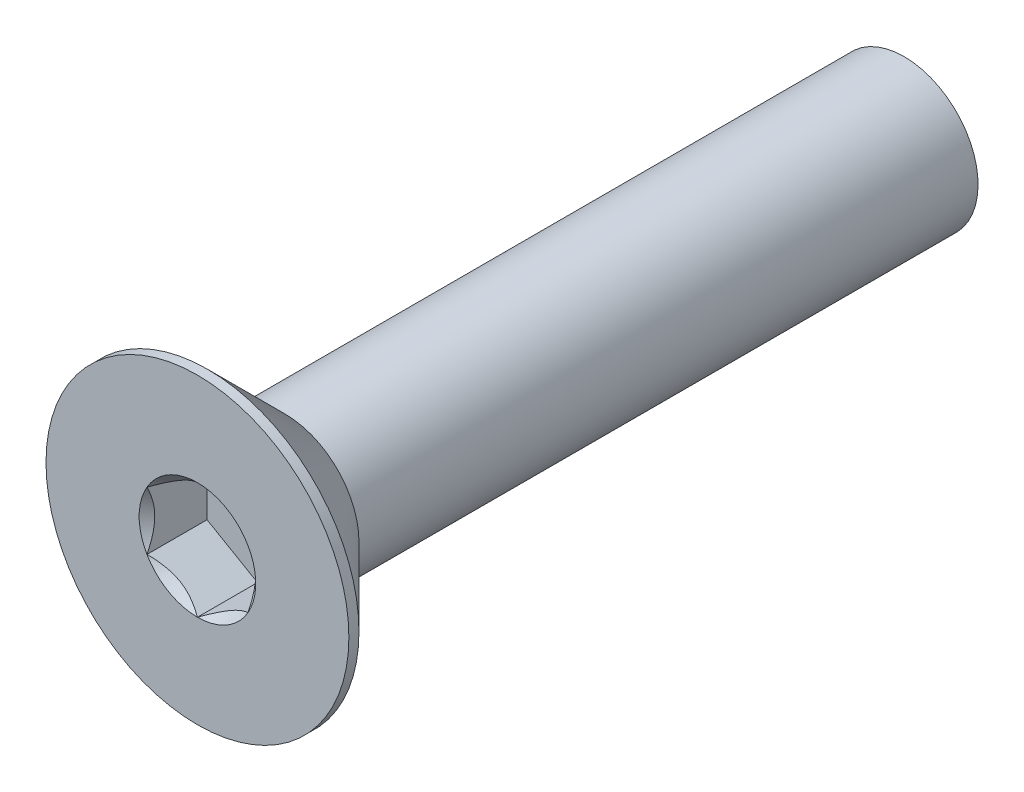
ISO-10303-21;
HEADER;
FILE_DESCRIPTION(('STEP AP214'),'2;1');
FILE_NAME('part.step','',(''),(''),'','','');
FILE_SCHEMA(('AUTOMOTIVE_DESIGN { 1 0 10303 214 1 1 1 1 }'));
ENDSEC;
DATA;
#1=APPLICATION_CONTEXT('core data for automotive mechanical design processes');
#2=APPLICATION_PROTOCOL_DEFINITION('international standard','automotive_design',2000,#1);
#3=PRODUCT_CONTEXT('',#1,'mechanical');
#4=PRODUCT('Part','Part','',(#3));
#5=PRODUCT_RELATED_PRODUCT_CATEGORY('part','',(#4));
#6=PRODUCT_DEFINITION_FORMATION('','',#4);
#7=PRODUCT_DEFINITION_CONTEXT('part definition',#1,'design');
#8=PRODUCT_DEFINITION('design','',#6,#7);
#9=PRODUCT_DEFINITION_SHAPE('','',#8);
#10=(LENGTH_UNIT() NAMED_UNIT(*) SI_UNIT(.MILLI.,.METRE.));
#11=(NAMED_UNIT(*) PLANE_ANGLE_UNIT() SI_UNIT($,.RADIAN.));
#12=(NAMED_UNIT(*) SI_UNIT($,.STERADIAN.) SOLID_ANGLE_UNIT());
#13=UNCERTAINTY_MEASURE_WITH_UNIT(LENGTH_MEASURE(1.E-05),#10,'distance_accuracy_value','');
#14=(GEOMETRIC_REPRESENTATION_CONTEXT(3) GLOBAL_UNCERTAINTY_ASSIGNED_CONTEXT((#13)) GLOBAL_UNIT_ASSIGNED_CONTEXT((#10,
#11,#12)) REPRESENTATION_CONTEXT('',''));
#15=CARTESIAN_POINT('',(0.,0.,0.));
#16=DIRECTION('',(0.,0.,1.));
#17=DIRECTION('',(1.,0.,0.));
#18=AXIS2_PLACEMENT_3D('',#15,#16,#17);
#19=CARTESIAN_POINT('',(1.,-0.577350269189626,-1.19));
#20=DIRECTION('',(0.,0.,1.));
#21=DIRECTION('',(1.,0.,0.));
#22=AXIS2_PLACEMENT_3D('',#19,#20,#21);
#23=PLANE('',#22);
#24=DIRECTION('',(0.,1.,0.));
#25=VECTOR('',#24,1.);
#26=CARTESIAN_POINT('',(-1.,0.577350269189626,-1.19));
#27=LINE('',#26,#25);
#28=CARTESIAN_POINT('',(-0.999999999999999,0.577350269189625,-1.19));
#29=VERTEX_POINT('',#28);
#30=CARTESIAN_POINT('',(-1.,-0.577350269189626,-1.19));
#31=VERTEX_POINT('',#30);
#32=EDGE_CURVE('E83',#29,#31,#27,.F.);
#33=ORIENTED_EDGE('',*,*,#32,.T.);
#34=DIRECTION('',(0.866025403784439,-0.5,0.));
#35=VECTOR('',#34,1.);
#36=CARTESIAN_POINT('',(-1.,-0.577350269189626,-1.19));
#37=LINE('',#36,#35);
#38=CARTESIAN_POINT('',(0.,-1.15470053837925,-1.19));
#39=VERTEX_POINT('',#38);
#40=EDGE_CURVE('E85',#31,#39,#37,.T.);
#41=ORIENTED_EDGE('',*,*,#40,.T.);
#42=DIRECTION('',(0.866025403784439,0.5,0.));
#43=VECTOR('',#42,1.);
#44=CARTESIAN_POINT('',(0.,-1.15470053837925,-1.19));
#45=LINE('',#44,#43);
#46=CARTESIAN_POINT('',(1.,-0.577350269189626,-1.19));
#47=VERTEX_POINT('',#46);
#48=EDGE_CURVE('E86',#39,#47,#45,.T.);
#49=ORIENTED_EDGE('',*,*,#48,.T.);
#50=DIRECTION('',(0.,1.,0.));
#51=VECTOR('',#50,1.);
#52=CARTESIAN_POINT('',(1.,-0.577350269189626,-1.19));
#53=LINE('',#52,#51);
#54=CARTESIAN_POINT('',(1.,0.577350269189626,-1.19));
#55=VERTEX_POINT('',#54);
#56=EDGE_CURVE('E72',#47,#55,#53,.T.);
#57=ORIENTED_EDGE('',*,*,#56,.T.);
#58=DIRECTION('',(-0.866025403784439,0.5,0.));
#59=VECTOR('',#58,1.);
#60=CARTESIAN_POINT('',(1.,0.577350269189626,-1.19));
#61=LINE('',#60,#59);
#62=CARTESIAN_POINT('',(0.,1.15470053837925,-1.19));
#63=VERTEX_POINT('',#62);
#64=EDGE_CURVE('E111',#55,#63,#61,.T.);
#65=ORIENTED_EDGE('',*,*,#64,.T.);
#66=DIRECTION('',(-0.866025403784439,-0.5,0.));
#67=VECTOR('',#66,1.);
#68=CARTESIAN_POINT('',(0.,1.15470053837925,-1.19));
#69=LINE('',#68,#67);
#70=EDGE_CURVE('E116',#63,#29,#69,.T.);
#71=ORIENTED_EDGE('',*,*,#70,.T.);
#72=EDGE_LOOP('',(#33,#41,#49,#57,#65,#71));
#73=FACE_BOUND('',#72,.T.);
#74=ADVANCED_FACE('F17',(#73),#23,.T.);
#75=CARTESIAN_POINT('',(0.,-1.15470053837925,-1.19));
#76=DIRECTION('',(0.5,-0.866025403784439,0.));
#77=DIRECTION('',(0.866025403784439,0.5,0.));
#78=AXIS2_PLACEMENT_3D('',#75,#76,#77);
#79=PLANE('',#78);
#80=CARTESIAN_POINT('',(-3.93149009094201E-11,-1.15470053837926,-9.981088786407E-11));
#81=CARTESIAN_POINT('',(0.0343705355201057,-1.13485670043636,-0.019824700422141));
#82=CARTESIAN_POINT('',(0.0693156756519455,-1.11468111438035,-0.0384849664872145));
#83=CARTESIAN_POINT('',(0.140572403035621,-1.07354102364821,-0.0726511232407905));
#84=CARTESIAN_POINT('',(0.176890763106012,-1.05257260868342,-0.0881380101422933));
#85=CARTESIAN_POINT('',(0.250125097696328,-1.01029074589262,-0.11466695978462));
#86=CARTESIAN_POINT('',(0.287022429458597,-0.988988061467716,-0.125775687570534));
#87=CARTESIAN_POINT('',(0.361628600499482,-0.945914168534358,-0.142891513233382));
#88=CARTESIAN_POINT('',(0.399335163701569,-0.924144274119301,-0.148911380305544));
#89=CARTESIAN_POINT('',(0.464327716043936,-0.886620806529054,-0.154341115390247));
#90=CARTESIAN_POINT('',(0.491529304810035,-0.87091596193258,-0.155143433217331));
#91=CARTESIAN_POINT('',(0.545879708710831,-0.839536741609904,-0.153791220399352));
#92=CARTESIAN_POINT('',(0.573028510861523,-0.823862373380022,-0.151636036594819));
#93=CARTESIAN_POINT('',(0.654087027893978,-0.777063216751215,-0.140876680449877));
#94=CARTESIAN_POINT('',(0.707593237347495,-0.746171392319914,-0.127977491939688));
#95=CARTESIAN_POINT('',(0.801462739355952,-0.691975810066637,-0.0968623195341796));
#96=CARTESIAN_POINT('',(0.842267871071583,-0.668416956286299,-0.0802830124023648));
#97=CARTESIAN_POINT('',(0.922281198810023,-0.622221239977752,-0.0429387151524039));
#98=CARTESIAN_POINT('',(0.961494106307927,-0.599581657278129,-0.0221873504710733));
#99=CARTESIAN_POINT('',(1.00000000003183,-0.577350269171246,-1.09229319045489E-10));
#100=B_SPLINE_CURVE_WITH_KNOTS('',3,(#80,#81,#82,#83,#84,#85,#86,#87,#88,#89,#90,#91,#92,#93,
#94,#95,#96,#97,#98,#99),.UNSPECIFIED.,.F.,.F.,(4,2,2,2,2,2,2,2,2,4),(0.,0.133182946587487,
0.267141541479663,0.398973326833972,0.530473323727982,0.624596460473079,0.718740387507005,
0.907081600610891,1.05673041335255,1.20589820631879),.UNSPECIFIED.);
#101=CARTESIAN_POINT('',(0.,-1.15470053839843,-1.08428152754095E-10));
#102=VERTEX_POINT('',#101);
#103=CARTESIAN_POINT('',(1.00000000001661,-0.577350269199215,-1.08427887794916E-10));
#104=VERTEX_POINT('',#103);
#105=EDGE_CURVE('E20',#102,#104,#100,.T.);
#106=ORIENTED_EDGE('',*,*,#105,.T.);
#107=DIRECTION('',(0.,0.,-1.));
#108=VECTOR('',#107,1.);
#109=CARTESIAN_POINT('',(1.,-0.577350269189626,-1.19));
#110=LINE('',#109,#108);
#111=EDGE_CURVE('E91',#104,#47,#110,.T.);
#112=ORIENTED_EDGE('',*,*,#111,.T.);
#113=ORIENTED_EDGE('',*,*,#48,.F.);
#114=DIRECTION('',(0.,0.,1.));
#115=VECTOR('',#114,1.);
#116=CARTESIAN_POINT('',(0.,-1.15470053837925,-1.19));
#117=LINE('',#116,#115);
#118=EDGE_CURVE('E59',#39,#102,#117,.T.);
#119=ORIENTED_EDGE('',*,*,#118,.T.);
#120=EDGE_LOOP('',(#106,#112,#113,#119));
#121=FACE_BOUND('',#120,.T.);
#122=ADVANCED_FACE('F90',(#121),#79,.F.);
#123=CARTESIAN_POINT('',(-1.,-0.577350269189626,-1.19));
#124=DIRECTION('',(-0.5,-0.866025403784439,0.));
#125=DIRECTION('',(0.866025403784439,-0.5,0.));
#126=AXIS2_PLACEMENT_3D('',#123,#124,#125);
#127=PLANE('',#126);
#128=CARTESIAN_POINT('',(-1.00000000001966,-0.577350269155583,-9.98096334677502E-11));
#129=CARTESIAN_POINT('',(-0.965629464472823,-0.597194107120269,-0.0198247004221396));
#130=CARTESIAN_POINT('',(-0.930684324346155,-0.617369693185242,-0.0384849664872131));
#131=CARTESIAN_POINT('',(-0.859427596966287,-0.658509783923978,-0.0726511232407891));
#132=CARTESIAN_POINT('',(-0.823109236894494,-0.679478198886334,-0.0881380101422919));
#133=CARTESIAN_POINT('',(-0.749874902303172,-0.721760061675394,-0.114666959784619));
#134=CARTESIAN_POINT('',(-0.71297757054127,-0.743062746100931,-0.125775687570532));
#135=CARTESIAN_POINT('',(-0.638371399500649,-0.786136639034746,-0.14289151323338));
#136=CARTESIAN_POINT('',(-0.600664836298461,-0.807906533449627,-0.148911380305542));
#137=CARTESIAN_POINT('',(-0.535672283956042,-0.845430001039785,-0.154341115390246));
#138=CARTESIAN_POINT('',(-0.508470695189959,-0.861134845636286,-0.155143433217329));
#139=CARTESIAN_POINT('',(-0.454120291289175,-0.892514065958982,-0.15379122039935));
#140=CARTESIAN_POINT('',(-0.426971489138479,-0.908188434188858,-0.151636036594817));
#141=CARTESIAN_POINT('',(-0.345912972106017,-0.954987590817655,-0.140876680449876));
#142=CARTESIAN_POINT('',(-0.292406762652503,-0.985879415248961,-0.127977491939686));
#143=CARTESIAN_POINT('',(-0.198537260644048,-1.04007499750224,-0.0968623195341786));
#144=CARTESIAN_POINT('',(-0.157732128928417,-1.06363385128258,-0.0802830124023638));
#145=CARTESIAN_POINT('',(-0.0777188011899764,-1.10982956759112,-0.0429387151524029));
#146=CARTESIAN_POINT('',(-0.0385058936920724,-1.13246915029075,-0.0221873504710723));
#147=CARTESIAN_POINT('',(3.18328951443562E-11,-1.15470053839763,-1.09228385770901E-10));
#148=B_SPLINE_CURVE_WITH_KNOTS('',3,(#128,#129,#130,#131,#132,#133,#134,#135,#136,#137,#138,
#139,#140,#141,#142,#143,#144,#145,#146,#147),.UNSPECIFIED.,.F.,.F.,(4,2,2,2,2,2,2,2,2,4),(0.,
0.133182946587487,0.267141541479662,0.398973326833972,0.530473323727981,0.624596460473079,
0.718740387507004,0.907081600610891,1.05673041335255,1.20589820631879),.UNSPECIFIED.);
#149=CARTESIAN_POINT('',(-1.00000000001661,-0.577350269199216,-1.08427378817555E-10));
#150=VERTEX_POINT('',#149);
#151=EDGE_CURVE('E95',#150,#102,#148,.T.);
#152=ORIENTED_EDGE('',*,*,#151,.T.);
#153=ORIENTED_EDGE('',*,*,#118,.F.);
#154=ORIENTED_EDGE('',*,*,#40,.F.);
#155=DIRECTION('',(0.,0.,1.));
#156=VECTOR('',#155,1.);
#157=CARTESIAN_POINT('',(-1.,-0.577350269189626,-1.19));
#158=LINE('',#157,#156);
#159=EDGE_CURVE('E97',#31,#150,#158,.T.);
#160=ORIENTED_EDGE('',*,*,#159,.T.);
#161=EDGE_LOOP('',(#152,#153,#154,#160));
#162=FACE_BOUND('',#161,.T.);
#163=ADVANCED_FACE('F93',(#162),#127,.F.);
#164=CARTESIAN_POINT('',(-1.,0.577350269189626,-1.19));
#165=DIRECTION('',(-1.,0.,0.));
#166=DIRECTION('',(0.,0.,1.));
#167=AXIS2_PLACEMENT_3D('',#164,#165,#166);
#168=PLANE('',#167);
#169=CARTESIAN_POINT('',(-0.999999999980349,0.577350269223676,-9.98097336921132E-11));
#170=CARTESIAN_POINT('',(-0.999999999992929,0.537662593316093,-0.0198247004221396));
#171=CARTESIAN_POINT('',(-0.999999999998101,0.497311421195105,-0.0384849664872131));
#172=CARTESIAN_POINT('',(-1.00000000000191,0.41503123972423,-0.0726511232407892));
#173=CARTESIAN_POINT('',(-1.00000000000051,0.373094409797089,-0.0881380101422921));
#174=CARTESIAN_POINT('',(-0.999999999999501,0.288530684217224,-0.114666959784619));
#175=CARTESIAN_POINT('',(-0.999999999999868,0.245925315366786,-0.125775687570532));
#176=CARTESIAN_POINT('',(-1.00000000000013,0.159777529499614,-0.142891513233381));
#177=CARTESIAN_POINT('',(-1.00000000000003,0.116237740669674,-0.148911380305542));
#178=CARTESIAN_POINT('',(-0.999999999999979,0.0411908054892712,-0.154341115390246));
#179=CARTESIAN_POINT('',(-0.999999999999994,0.00978111629629506,-0.155143433217329));
#180=CARTESIAN_POINT('',(-1.00000000000001,-0.0529773243490767,-0.15379122039935));
#181=CARTESIAN_POINT('',(-1.,-0.0843260608088347,-0.151636036594817));
#182=CARTESIAN_POINT('',(-0.999999999999996,-0.177924374066439,-0.140876680449876));
#183=CARTESIAN_POINT('',(-0.999999999999999,-0.239708022929046,-0.127977491939686));
#184=CARTESIAN_POINT('',(-1.,-0.348099187435602,-0.0968623195341786));
#185=CARTESIAN_POINT('',(-1.,-0.395216894996278,-0.0802830124023637));
#186=CARTESIAN_POINT('',(-1.,-0.48760832761337,-0.0429387151524027));
#187=CARTESIAN_POINT('',(-0.999999999999999,-0.532887493012616,-0.0221873504710721));
#188=CARTESIAN_POINT('',(-1.,-0.577350269226384,-1.09228152961273E-10));
#189=B_SPLINE_CURVE_WITH_KNOTS('',3,(#169,#170,#171,#172,#173,#174,#175,#176,#177,#178,#179,
#180,#181,#182,#183,#184,#185,#186,#187,#188),.UNSPECIFIED.,.F.,.F.,(4,2,2,2,2,2,2,2,2,4),(0.,
0.133182946587487,0.267141541479662,0.398973326833972,0.530473323727981,0.624596460473079,
0.718740387507004,0.907081600610891,1.05673041335255,1.20589820631879),.UNSPECIFIED.);
#190=CARTESIAN_POINT('',(-1.00000000001661,0.577350269199215,-1.08428019788564E-10));
#191=VERTEX_POINT('',#190);
#192=EDGE_CURVE('E194',#191,#150,#189,.T.);
#193=ORIENTED_EDGE('',*,*,#192,.T.);
#194=ORIENTED_EDGE('',*,*,#159,.F.);
#195=ORIENTED_EDGE('',*,*,#32,.F.);
#196=DIRECTION('',(0.,0.,1.));
#197=VECTOR('',#196,1.);
#198=CARTESIAN_POINT('',(-0.999999999999999,0.577350269189625,-1.19));
#199=LINE('',#198,#197);
#200=EDGE_CURVE('E113',#29,#191,#199,.T.);
#201=ORIENTED_EDGE('',*,*,#200,.T.);
#202=EDGE_LOOP('',(#193,#194,#195,#201));
#203=FACE_BOUND('',#202,.T.);
#204=ADVANCED_FACE('F204',(#203),#168,.F.);
#205=CARTESIAN_POINT('',(0.,1.15470053837925,-1.19));
#206=DIRECTION('',(-0.5,0.866025403784439,0.));
#207=DIRECTION('',(-0.866025403784439,-0.5,0.));
#208=AXIS2_PLACEMENT_3D('',#205,#206,#207);
#209=PLANE('',#208);
#210=CARTESIAN_POINT('',(3.93151655791116E-11,1.15470053837926,-9.98107697781813E-11));
#211=CARTESIAN_POINT('',(-0.0343705355201054,1.13485670043636,-0.0198247004221408));
#212=CARTESIAN_POINT('',(-0.0693156756519452,1.11468111438035,-0.0384849664872144));
#213=CARTESIAN_POINT('',(-0.140572403035621,1.07354102364821,-0.0726511232407903));
#214=CARTESIAN_POINT('',(-0.176890763106012,1.05257260868342,-0.0881380101422932));
#215=CARTESIAN_POINT('',(-0.250125097696327,1.01029074589262,-0.11466695978462));
#216=CARTESIAN_POINT('',(-0.287022429458596,0.988988061467716,-0.125775687570534));
#217=CARTESIAN_POINT('',(-0.361628600499482,0.945914168534359,-0.142891513233382));
#218=CARTESIAN_POINT('',(-0.399335163701568,0.924144274119301,-0.148911380305544));
#219=CARTESIAN_POINT('',(-0.464327716043936,0.886620806529055,-0.154341115390247));
#220=CARTESIAN_POINT('',(-0.491529304810035,0.87091596193258,-0.155143433217331));
#221=CARTESIAN_POINT('',(-0.54587970871083,0.839536741609904,-0.153791220399352));
#222=CARTESIAN_POINT('',(-0.573028510861522,0.823862373380022,-0.151636036594819));
#223=CARTESIAN_POINT('',(-0.654087027893978,0.777063216751215,-0.140876680449878));
#224=CARTESIAN_POINT('',(-0.707593237347495,0.746171392319914,-0.127977491939688));
#225=CARTESIAN_POINT('',(-0.801462739355952,0.691975810066637,-0.09686231953418));
#226=CARTESIAN_POINT('',(-0.842267871071583,0.668416956286299,-0.0802830124023651));
#227=CARTESIAN_POINT('',(-0.922281198810023,0.622221239977752,-0.0429387151524039));
#228=CARTESIAN_POINT('',(-0.961494106307927,0.599581657278129,-0.0221873504710733));
#229=CARTESIAN_POINT('',(-1.00000000003183,0.577350269171245,-1.09229131326547E-10));
#230=B_SPLINE_CURVE_WITH_KNOTS('',3,(#210,#211,#212,#213,#214,#215,#216,#217,#218,#219,#220,
#221,#222,#223,#224,#225,#226,#227,#228,#229),.UNSPECIFIED.,.F.,.F.,(4,2,2,2,2,2,2,2,2,4),(0.,
0.133182946587487,0.267141541479663,0.398973326833972,0.530473323727982,0.624596460473079,
0.718740387507005,0.907081600610891,1.05673041335255,1.20589820631879),.UNSPECIFIED.);
#231=CARTESIAN_POINT('',(0.,1.15470053839843,-1.08428124739921E-10));
#232=VERTEX_POINT('',#231);
#233=EDGE_CURVE('E186',#232,#191,#230,.T.);
#234=ORIENTED_EDGE('',*,*,#233,.T.);
#235=ORIENTED_EDGE('',*,*,#200,.F.);
#236=ORIENTED_EDGE('',*,*,#70,.F.);
#237=DIRECTION('',(0.,0.,1.));
#238=VECTOR('',#237,1.);
#239=CARTESIAN_POINT('',(0.,1.15470053837925,-1.19));
#240=LINE('',#239,#238);
#241=EDGE_CURVE('E108',#63,#232,#240,.T.);
#242=ORIENTED_EDGE('',*,*,#241,.T.);
#243=EDGE_LOOP('',(#234,#235,#236,#242));
#244=FACE_BOUND('',#243,.T.);
#245=ADVANCED_FACE('F200',(#244),#209,.F.);
#246=CARTESIAN_POINT('',(1.,0.577350269189626,-1.19));
#247=DIRECTION('',(0.5,0.866025403784439,0.));
#248=DIRECTION('',(-0.866025403784439,0.5,0.));
#249=AXIS2_PLACEMENT_3D('',#246,#247,#248);
#250=PLANE('',#249);
#251=CARTESIAN_POINT('',(1.00000000001966,0.577350269155583,-9.98095494207407E-11));
#252=CARTESIAN_POINT('',(0.965629464472823,0.597194107120269,-0.0198247004221397));
#253=CARTESIAN_POINT('',(0.930684324346155,0.617369693185242,-0.0384849664872132));
#254=CARTESIAN_POINT('',(0.859427596966287,0.658509783923978,-0.0726511232407891));
#255=CARTESIAN_POINT('',(0.823109236894494,0.679478198886334,-0.0881380101422918));
#256=CARTESIAN_POINT('',(0.749874902303172,0.721760061675394,-0.114666959784619));
#257=CARTESIAN_POINT('',(0.712977570541271,0.743062746100931,-0.125775687570532));
#258=CARTESIAN_POINT('',(0.638371399500649,0.786136639034746,-0.142891513233381));
#259=CARTESIAN_POINT('',(0.600664836298461,0.807906533449627,-0.148911380305542));
#260=CARTESIAN_POINT('',(0.535672283956042,0.845430001039784,-0.154341115390246));
#261=CARTESIAN_POINT('',(0.508470695189959,0.861134845636286,-0.155143433217329));
#262=CARTESIAN_POINT('',(0.454120291289175,0.892514065958982,-0.15379122039935));
#263=CARTESIAN_POINT('',(0.426971489138479,0.908188434188858,-0.151636036594817));
#264=CARTESIAN_POINT('',(0.345912972106017,0.954987590817654,-0.140876680449876));
#265=CARTESIAN_POINT('',(0.292406762652503,0.985879415248961,-0.127977491939686));
#266=CARTESIAN_POINT('',(0.198537260644048,1.04007499750224,-0.0968623195341785));
#267=CARTESIAN_POINT('',(0.157732128928417,1.06363385128258,-0.0802830124023638));
#268=CARTESIAN_POINT('',(0.0777188011899766,1.10982956759112,-0.042938715152403));
#269=CARTESIAN_POINT('',(0.0385058936920726,1.13246915029075,-0.0221873504710725));
#270=CARTESIAN_POINT('',(-3.18326351011692E-11,1.15470053839763,-1.0922858632033E-10));
#271=B_SPLINE_CURVE_WITH_KNOTS('',3,(#251,#252,#253,#254,#255,#256,#257,#258,#259,#260,#261,
#262,#263,#264,#265,#266,#267,#268,#269,#270),.UNSPECIFIED.,.F.,.F.,(4,2,2,2,2,2,2,2,2,4),(0.,
0.133182946587487,0.267141541479662,0.398973326833972,0.530473323727981,0.624596460473079,
0.718740387507004,0.907081600610891,1.05673041335255,1.20589820631879),.UNSPECIFIED.);
#272=CARTESIAN_POINT('',(1.00000000001661,0.577350269199216,-1.08427368873374E-10));
#273=VERTEX_POINT('',#272);
#274=EDGE_CURVE('E156',#273,#232,#271,.T.);
#275=ORIENTED_EDGE('',*,*,#274,.T.);
#276=ORIENTED_EDGE('',*,*,#241,.F.);
#277=ORIENTED_EDGE('',*,*,#64,.F.);
#278=DIRECTION('',(0.,0.,-1.));
#279=VECTOR('',#278,1.);
#280=CARTESIAN_POINT('',(1.,0.577350269189626,-1.19));
#281=LINE('',#280,#279);
#282=EDGE_CURVE('E40',#55,#273,#281,.F.);
#283=ORIENTED_EDGE('',*,*,#282,.T.);
#284=EDGE_LOOP('',(#275,#276,#277,#283));
#285=FACE_BOUND('',#284,.T.);
#286=ADVANCED_FACE('F203',(#285),#250,.F.);
#287=CARTESIAN_POINT('',(1.,-0.577350269189626,-1.19));
#288=DIRECTION('',(1.,0.,0.));
#289=DIRECTION('',(0.,0.,-1.));
#290=AXIS2_PLACEMENT_3D('',#287,#288,#289);
#291=PLANE('',#290);
#292=CARTESIAN_POINT('',(0.999999999980349,-0.577350269223676,-9.98096008015795E-11));
#293=CARTESIAN_POINT('',(0.999999999992929,-0.537662593316093,-0.0198247004221395));
#294=CARTESIAN_POINT('',(0.999999999998101,-0.497311421195106,-0.0384849664872131));
#295=CARTESIAN_POINT('',(1.00000000000191,-0.41503123972423,-0.0726511232407892));
#296=CARTESIAN_POINT('',(1.00000000000051,-0.373094409797089,-0.0881380101422921));
#297=CARTESIAN_POINT('',(0.999999999999501,-0.288530684217224,-0.114666959784619));
#298=CARTESIAN_POINT('',(0.999999999999868,-0.245925315366786,-0.125775687570532));
#299=CARTESIAN_POINT('',(1.00000000000013,-0.159777529499614,-0.142891513233381));
#300=CARTESIAN_POINT('',(1.00000000000003,-0.116237740669674,-0.148911380305542));
#301=CARTESIAN_POINT('',(0.999999999999979,-0.0411908054892709,-0.154341115390246));
#302=CARTESIAN_POINT('',(0.999999999999994,-0.00978111629629477,-0.155143433217329));
#303=CARTESIAN_POINT('',(1.00000000000001,0.052977324349077,-0.15379122039935));
#304=CARTESIAN_POINT('',(1.,0.084326060808835,-0.151636036594817));
#305=CARTESIAN_POINT('',(0.999999999999996,0.177924374066439,-0.140876680449876));
#306=CARTESIAN_POINT('',(0.999999999999999,0.239708022929047,-0.127977491939686));
#307=CARTESIAN_POINT('',(1.,0.348099187435603,-0.0968623195341784));
#308=CARTESIAN_POINT('',(1.,0.395216894996278,-0.0802830124023636));
#309=CARTESIAN_POINT('',(1.,0.48760832761337,-0.0429387151524028));
#310=CARTESIAN_POINT('',(0.999999999999999,0.532887493012616,-0.0221873504710722));
#311=CARTESIAN_POINT('',(1.,0.577350269226384,-1.09228152479802E-10));
#312=B_SPLINE_CURVE_WITH_KNOTS('',3,(#292,#293,#294,#295,#296,#297,#298,#299,#300,#301,#302,
#303,#304,#305,#306,#307,#308,#309,#310,#311),.UNSPECIFIED.,.F.,.F.,(4,2,2,2,2,2,2,2,2,4),(0.,
0.133182946587487,0.267141541479663,0.398973326833972,0.530473323727982,0.624596460473079,
0.718740387507005,0.907081600610892,1.05673041335255,1.20589820631879),.UNSPECIFIED.);
#313=EDGE_CURVE('E148',#104,#273,#312,.T.);
#314=ORIENTED_EDGE('',*,*,#313,.T.);
#315=ORIENTED_EDGE('',*,*,#282,.F.);
#316=ORIENTED_EDGE('',*,*,#56,.F.);
#317=ORIENTED_EDGE('',*,*,#111,.F.);
#318=EDGE_LOOP('',(#314,#315,#316,#317));
#319=FACE_BOUND('',#318,.T.);
#320=ADVANCED_FACE('F164',(#319),#291,.F.);
#321=CARTESIAN_POINT('',(0.,0.,-1.70530256582424E-10));
#322=DIRECTION('',(0.,0.,1.));
#323=DIRECTION('',(1.,0.,0.));
#324=AXIS2_PLACEMENT_3D('',#321,#322,#323);
#325=CONICAL_SURFACE('',#324,1.15470053833633,0.785398163397448);
#326=ORIENTED_EDGE('',*,*,#105,.F.);
#327=CARTESIAN_POINT('',(0.,0.,-1.13686837721616E-10));
#328=DIRECTION('',(0.,0.,1.));
#329=DIRECTION('',(1.,0.,0.));
#330=AXIS2_PLACEMENT_3D('',#327,#328,#329);
#331=CIRCLE('',#330,1.15470053839317);
#332=EDGE_CURVE('E145',#104,#102,#331,.F.);
#333=ORIENTED_EDGE('',*,*,#332,.F.);
#334=EDGE_LOOP('',(#326,#333));
#335=FACE_BOUND('',#334,.T.);
#336=ADVANCED_FACE('F221',(#335),#325,.F.);
#337=CARTESIAN_POINT('',(0.,0.,-1.70530256582424E-10));
#338=DIRECTION('',(0.,0.,1.));
#339=DIRECTION('',(1.,0.,0.));
#340=AXIS2_PLACEMENT_3D('',#337,#338,#339);
#341=CONICAL_SURFACE('',#340,1.15470053833633,0.785398163397448);
#342=ORIENTED_EDGE('',*,*,#151,.F.);
#343=CARTESIAN_POINT('',(0.,0.,-1.13686837721616E-10));
#344=DIRECTION('',(0.,0.,1.));
#345=DIRECTION('',(1.,0.,0.));
#346=AXIS2_PLACEMENT_3D('',#343,#344,#345);
#347=CIRCLE('',#346,1.15470053839317);
#348=EDGE_CURVE('E142',#102,#150,#347,.F.);
#349=ORIENTED_EDGE('',*,*,#348,.F.);
#350=EDGE_LOOP('',(#342,#349));
#351=FACE_BOUND('',#350,.T.);
#352=ADVANCED_FACE('F218',(#351),#341,.F.);
#353=CARTESIAN_POINT('',(0.,0.,-1.70530256582424E-10));
#354=DIRECTION('',(0.,0.,1.));
#355=DIRECTION('',(1.,0.,0.));
#356=AXIS2_PLACEMENT_3D('',#353,#354,#355);
#357=CONICAL_SURFACE('',#356,1.15470053833633,0.785398163397448);
#358=ORIENTED_EDGE('',*,*,#192,.F.);
#359=CARTESIAN_POINT('',(0.,0.,-1.13686837721616E-10));
#360=DIRECTION('',(0.,0.,1.));
#361=DIRECTION('',(1.,0.,0.));
#362=AXIS2_PLACEMENT_3D('',#359,#360,#361);
#363=CIRCLE('',#362,1.15470053839317);
#364=EDGE_CURVE('E139',#150,#191,#363,.F.);
#365=ORIENTED_EDGE('',*,*,#364,.F.);
#366=EDGE_LOOP('',(#358,#365));
#367=FACE_BOUND('',#366,.T.);
#368=ADVANCED_FACE('F182',(#367),#357,.F.);
#369=CARTESIAN_POINT('',(0.,0.,-1.70530256582424E-10));
#370=DIRECTION('',(0.,0.,1.));
#371=DIRECTION('',(1.,0.,0.));
#372=AXIS2_PLACEMENT_3D('',#369,#370,#371);
#373=CONICAL_SURFACE('',#372,1.15470053833633,0.785398163397448);
#374=ORIENTED_EDGE('',*,*,#233,.F.);
#375=CARTESIAN_POINT('',(0.,0.,-1.13686837721616E-10));
#376=DIRECTION('',(0.,0.,1.));
#377=DIRECTION('',(1.,0.,0.));
#378=AXIS2_PLACEMENT_3D('',#375,#376,#377);
#379=CIRCLE('',#378,1.15470053839317);
#380=EDGE_CURVE('E136',#191,#232,#379,.F.);
#381=ORIENTED_EDGE('',*,*,#380,.F.);
#382=EDGE_LOOP('',(#374,#381));
#383=FACE_BOUND('',#382,.T.);
#384=ADVANCED_FACE('F177',(#383),#373,.F.);
#385=CARTESIAN_POINT('',(0.,0.,-1.70530256582424E-10));
#386=DIRECTION('',(0.,0.,1.));
#387=DIRECTION('',(1.,0.,0.));
#388=AXIS2_PLACEMENT_3D('',#385,#386,#387);
#389=CONICAL_SURFACE('',#388,1.15470053833633,0.785398163397448);
#390=ORIENTED_EDGE('',*,*,#274,.F.);
#391=CARTESIAN_POINT('',(0.,0.,-1.13686837721616E-10));
#392=DIRECTION('',(0.,0.,1.));
#393=DIRECTION('',(1.,0.,0.));
#394=AXIS2_PLACEMENT_3D('',#391,#392,#393);
#395=CIRCLE('',#394,1.15470053839317);
#396=EDGE_CURVE('E133',#232,#273,#395,.F.);
#397=ORIENTED_EDGE('',*,*,#396,.F.);
#398=EDGE_LOOP('',(#390,#397));
#399=FACE_BOUND('',#398,.T.);
#400=ADVANCED_FACE('F171',(#399),#389,.F.);
#401=CARTESIAN_POINT('',(0.,0.,-1.70530256582424E-10));
#402=DIRECTION('',(0.,0.,1.));
#403=DIRECTION('',(1.,0.,0.));
#404=AXIS2_PLACEMENT_3D('',#401,#402,#403);
#405=CONICAL_SURFACE('',#404,1.15470053833633,0.785398163397448);
#406=CARTESIAN_POINT('',(0.,0.,-1.13686837721616E-10));
#407=DIRECTION('',(0.,0.,1.));
#408=DIRECTION('',(1.,0.,0.));
#409=AXIS2_PLACEMENT_3D('',#406,#407,#408);
#410=CIRCLE('',#409,1.15470053839317);
#411=EDGE_CURVE('E130',#273,#104,#410,.F.);
#412=ORIENTED_EDGE('',*,*,#411,.F.);
#413=ORIENTED_EDGE('',*,*,#313,.F.);
#414=EDGE_LOOP('',(#412,#413));
#415=FACE_BOUND('',#414,.T.);
#416=ADVANCED_FACE('F166',(#415),#405,.F.);
#417=CARTESIAN_POINT('',(0.,-1.5,0.));
#418=DIRECTION('',(0.,0.,1.));
#419=DIRECTION('',(0.,-1.,0.));
#420=AXIS2_PLACEMENT_3D('',#417,#418,#419);
#421=PLANE('',#420);
#422=ORIENTED_EDGE('',*,*,#396,.T.);
#423=ORIENTED_EDGE('',*,*,#411,.T.);
#424=ORIENTED_EDGE('',*,*,#332,.T.);
#425=ORIENTED_EDGE('',*,*,#348,.T.);
#426=ORIENTED_EDGE('',*,*,#364,.T.);
#427=ORIENTED_EDGE('',*,*,#380,.T.);
#428=EDGE_LOOP('',(#422,#423,#424,#425,#426,#427));
#429=FACE_BOUND('',#428,.T.);
#430=CARTESIAN_POINT('',(0.,0.,0.));
#431=DIRECTION('',(0.,0.,1.));
#432=DIRECTION('',(0.,-1.,0.));
#433=AXIS2_PLACEMENT_3D('',#430,#431,#432);
#434=CIRCLE('',#433,3.);
#435=CARTESIAN_POINT('',(0.,-3.,0.));
#436=VERTEX_POINT('',#435);
#437=EDGE_CURVE('E127',#436,#436,#434,.F.);
#438=ORIENTED_EDGE('',*,*,#437,.F.);
#439=EDGE_LOOP('',(#438));
#440=FACE_BOUND('',#439,.T.);
#441=ADVANCED_FACE('F170',(#429,#440),#421,.T.);
#442=CARTESIAN_POINT('',(0.,0.,0.));
#443=DIRECTION('',(0.,0.,1.));
#444=DIRECTION('',(0.,-1.,0.));
#445=AXIS2_PLACEMENT_3D('',#442,#443,#444);
#446=CYLINDRICAL_SURFACE('',#445,3.);
#447=CARTESIAN_POINT('',(0.,0.,-0.200000000006641));
#448=DIRECTION('',(0.,0.,1.));
#449=DIRECTION('',(0.,-1.,0.));
#450=AXIS2_PLACEMENT_3D('',#447,#448,#449);
#451=CIRCLE('',#450,3.00000000004275);
#452=CARTESIAN_POINT('',(0.,-3.00000000004275,-0.200000000006639));
#453=VERTEX_POINT('',#452);
#454=EDGE_CURVE('E126',#453,#453,#451,.F.);
#455=ORIENTED_EDGE('',*,*,#454,.F.);
#456=EDGE_LOOP('',(#455));
#457=FACE_BOUND('',#456,.T.);
#458=ORIENTED_EDGE('',*,*,#437,.T.);
#459=EDGE_LOOP('',(#458));
#460=FACE_BOUND('',#459,.T.);
#461=ADVANCED_FACE('F245',(#457,#460),#446,.T.);
#462=CARTESIAN_POINT('',(0.,-1.5,-14.));
#463=DIRECTION('',(0.,0.,-1.));
#464=DIRECTION('',(0.,1.,0.));
#465=AXIS2_PLACEMENT_3D('',#462,#463,#464);
#466=PLANE('',#465);
#467=CARTESIAN_POINT('',(0.,0.,-14.));
#468=DIRECTION('',(0.,0.,-1.));
#469=DIRECTION('',(0.,1.,0.));
#470=AXIS2_PLACEMENT_3D('',#467,#468,#469);
#471=CIRCLE('',#470,1.4635);
#472=CARTESIAN_POINT('',(0.,1.4635,-14.));
#473=VERTEX_POINT('',#472);
#474=EDGE_CURVE('E31',#473,#473,#471,.F.);
#475=ORIENTED_EDGE('',*,*,#474,.F.);
#476=EDGE_LOOP('',(#475));
#477=FACE_BOUND('',#476,.T.);
#478=ADVANCED_FACE('F239',(#477),#466,.T.);
#479=CARTESIAN_POINT('',(0.,0.,-0.200000000006642));
#480=DIRECTION('',(0.,0.,1.));
#481=DIRECTION('',(0.,-1.,0.));
#482=AXIS2_PLACEMENT_3D('',#479,#480,#481);
#483=CONICAL_SURFACE('',#482,3.00000000004275,0.785398163415947);
#484=CARTESIAN_POINT('',(0.,0.,-1.7365));
#485=DIRECTION('',(0.,0.,-1.));
#486=DIRECTION('',(0.,1.,0.));
#487=AXIS2_PLACEMENT_3D('',#484,#485,#486);
#488=CIRCLE('',#487,1.4635);
#489=CARTESIAN_POINT('',(0.,1.4635,-1.7365));
#490=VERTEX_POINT('',#489);
#491=EDGE_CURVE('E11',#490,#490,#488,.T.);
#492=ORIENTED_EDGE('',*,*,#491,.F.);
#493=EDGE_LOOP('',(#492));
#494=FACE_BOUND('',#493,.T.);
#495=ORIENTED_EDGE('',*,*,#454,.T.);
#496=EDGE_LOOP('',(#495));
#497=FACE_BOUND('',#496,.T.);
#498=ADVANCED_FACE('F233',(#494,#497),#483,.T.);
#499=CARTESIAN_POINT('',(0.,0.,-14.));
#500=DIRECTION('',(0.,0.,-1.));
#501=DIRECTION('',(0.,1.,0.));
#502=AXIS2_PLACEMENT_3D('',#499,#500,#501);
#503=CYLINDRICAL_SURFACE('',#502,1.4635);
#504=ORIENTED_EDGE('',*,*,#491,.T.);
#505=EDGE_LOOP('',(#504));
#506=FACE_BOUND('',#505,.T.);
#507=ORIENTED_EDGE('',*,*,#474,.T.);
#508=EDGE_LOOP('',(#507));
#509=FACE_BOUND('',#508,.T.);
#510=ADVANCED_FACE('F231',(#506,#509),#503,.T.);
#511=CLOSED_SHELL('',(#74,#122,#163,#204,#245,#286,#320,#336,#352,#368,#384,#400,#416,#441,#461,
#478,#498,#510));
#512=MANIFOLD_SOLID_BREP('B1',#511);
#513=ADVANCED_BREP_SHAPE_REPRESENTATION('',(#18,#512),#14);
#514=SHAPE_DEFINITION_REPRESENTATION(#9,#513);
ENDSEC;
END-ISO-10303-21;
